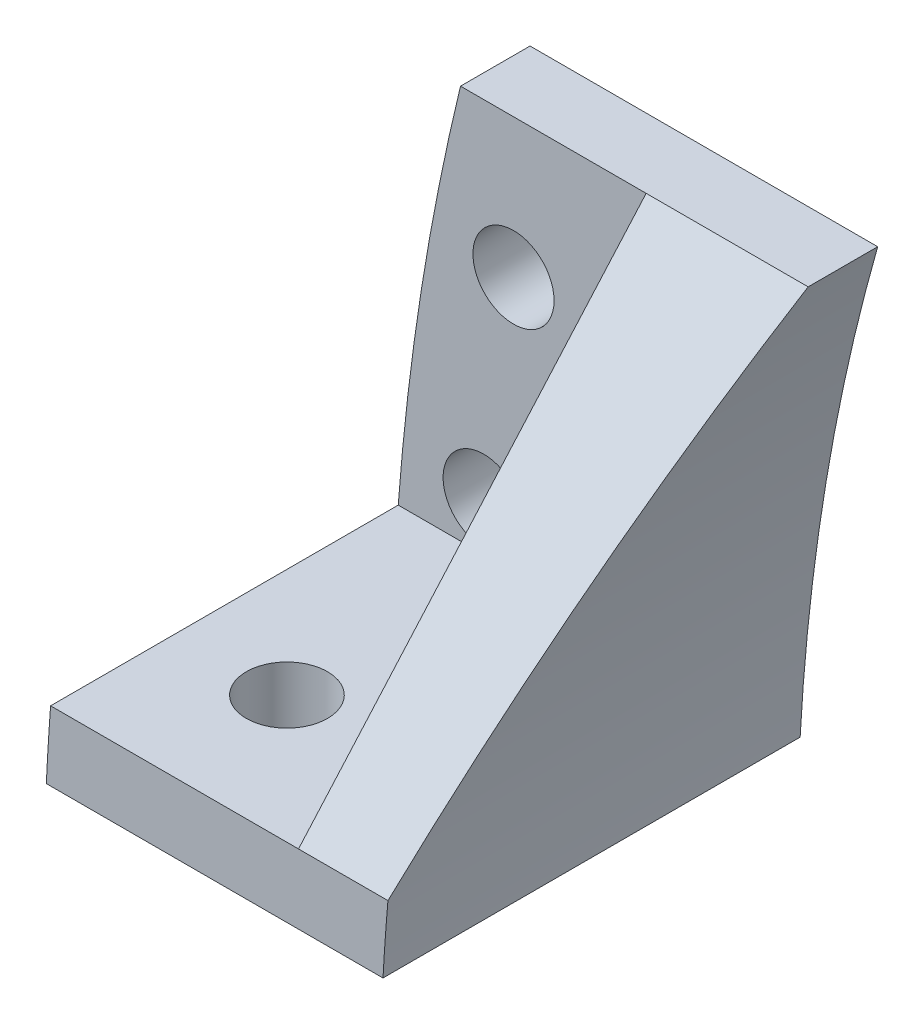
ISO-10303-21;
HEADER;
FILE_DESCRIPTION(('STEP AP214'),'2;1');
FILE_NAME('part.step','',(''),(''),'','','');
FILE_SCHEMA(('AUTOMOTIVE_DESIGN { 1 0 10303 214 1 1 1 1 }'));
ENDSEC;
DATA;
#1=APPLICATION_CONTEXT('core data for automotive mechanical design processes');
#2=APPLICATION_PROTOCOL_DEFINITION('international standard','automotive_design',2000,#1);
#3=PRODUCT_CONTEXT('',#1,'mechanical');
#4=PRODUCT('Part','Part','',(#3));
#5=PRODUCT_RELATED_PRODUCT_CATEGORY('part','',(#4));
#6=PRODUCT_DEFINITION_FORMATION('','',#4);
#7=PRODUCT_DEFINITION_CONTEXT('part definition',#1,'design');
#8=PRODUCT_DEFINITION('design','',#6,#7);
#9=PRODUCT_DEFINITION_SHAPE('','',#8);
#10=(LENGTH_UNIT() NAMED_UNIT(*) SI_UNIT(.MILLI.,.METRE.));
#11=(NAMED_UNIT(*) PLANE_ANGLE_UNIT() SI_UNIT($,.RADIAN.));
#12=(NAMED_UNIT(*) SI_UNIT($,.STERADIAN.) SOLID_ANGLE_UNIT());
#13=UNCERTAINTY_MEASURE_WITH_UNIT(LENGTH_MEASURE(1.E-05),#10,'distance_accuracy_value','');
#14=(GEOMETRIC_REPRESENTATION_CONTEXT(3) GLOBAL_UNCERTAINTY_ASSIGNED_CONTEXT((#13)) GLOBAL_UNIT_ASSIGNED_CONTEXT((#10,
#11,#12)) REPRESENTATION_CONTEXT('',''));
#15=CARTESIAN_POINT('',(0.,0.,0.));
#16=DIRECTION('',(0.,0.,1.));
#17=DIRECTION('',(1.,0.,0.));
#18=AXIS2_PLACEMENT_3D('',#15,#16,#17);
#19=CARTESIAN_POINT('',(106.,0.,3.));
#20=DIRECTION('',(0.,0.,-1.));
#21=DIRECTION('',(-1.,0.,0.));
#22=AXIS2_PLACEMENT_3D('',#19,#20,#21);
#23=PLANE('',#22);
#24=CARTESIAN_POINT('',(3.98897118448416,9.99999999999999,3.));
#25=DIRECTION('',(0.,0.,1.));
#26=DIRECTION('',(1.,0.,0.));
#27=AXIS2_PLACEMENT_3D('',#24,#25,#26);
#28=CIRCLE('',#27,1.75);
#29=CARTESIAN_POINT('',(5.73897118448416,9.99999999999999,3.));
#30=VERTEX_POINT('',#29);
#31=EDGE_CURVE('E120',#30,#30,#28,.T.);
#32=ORIENTED_EDGE('',*,*,#31,.F.);
#33=EDGE_LOOP('',(#32));
#34=FACE_BOUND('',#33,.T.);
#35=CARTESIAN_POINT('',(5.27636821480273,19.,3.));
#36=DIRECTION('',(0.,0.,1.));
#37=DIRECTION('',(1.,0.,0.));
#38=AXIS2_PLACEMENT_3D('',#35,#36,#37);
#39=CIRCLE('',#38,1.75);
#40=CARTESIAN_POINT('',(7.02636821480274,19.,3.));
#41=VERTEX_POINT('',#40);
#42=EDGE_CURVE('E321',#41,#41,#39,.T.);
#43=ORIENTED_EDGE('',*,*,#42,.F.);
#44=EDGE_LOOP('',(#43));
#45=FACE_BOUND('',#44,.T.);
#46=DIRECTION('',(0.,1.,0.));
#47=VECTOR('',#46,1.);
#48=CARTESIAN_POINT('',(11.,25.,3.));
#49=LINE('',#48,#47);
#50=CARTESIAN_POINT('',(11.,7.99999999999999,3.));
#51=VERTEX_POINT('',#50);
#52=CARTESIAN_POINT('',(11.,25.,3.));
#53=VERTEX_POINT('',#52);
#54=EDGE_CURVE('E298',#51,#53,#49,.T.);
#55=ORIENTED_EDGE('',*,*,#54,.T.);
#56=DIRECTION('',(-1.,0.,0.));
#57=VECTOR('',#56,1.);
#58=CARTESIAN_POINT('',(2.9902917196636,25.,3.));
#59=LINE('',#58,#57);
#60=CARTESIAN_POINT('',(2.9902917196636,25.,3.));
#61=VERTEX_POINT('',#60);
#62=EDGE_CURVE('E61',#53,#61,#59,.T.);
#63=ORIENTED_EDGE('',*,*,#62,.T.);
#64=CARTESIAN_POINT('',(106.,0.,3.));
#65=DIRECTION('',(0.,0.,1.));
#66=DIRECTION('',(-1.,0.,0.));
#67=AXIS2_PLACEMENT_3D('',#64,#65,#66);
#68=CIRCLE('',#67,106.);
#69=CARTESIAN_POINT('',(0.302317906209493,7.99999999999999,3.));
#70=VERTEX_POINT('',#69);
#71=EDGE_CURVE('E107',#61,#70,#68,.T.);
#72=ORIENTED_EDGE('',*,*,#71,.T.);
#73=DIRECTION('',(-1.,0.,0.));
#74=VECTOR('',#73,1.);
#75=CARTESIAN_POINT('',(0.302317906209493,7.99999999999999,3.));
#76=LINE('',#75,#74);
#77=EDGE_CURVE('E304',#51,#70,#76,.T.);
#78=ORIENTED_EDGE('',*,*,#77,.F.);
#79=EDGE_LOOP('',(#55,#63,#72,#78));
#80=FACE_BOUND('',#79,.T.);
#81=ADVANCED_FACE('F37',(#34,#45,#80),#23,.F.);
#82=CARTESIAN_POINT('',(0.302317906209493,7.99999999999999,18.));
#83=DIRECTION('',(0.,-1.,0.));
#84=DIRECTION('',(0.,0.,-1.));
#85=AXIS2_PLACEMENT_3D('',#82,#83,#84);
#86=PLANE('',#85);
#87=CARTESIAN_POINT('',(5.,7.99999999999999,12.5));
#88=DIRECTION('',(0.,1.,0.));
#89=DIRECTION('',(0.,0.,1.));
#90=AXIS2_PLACEMENT_3D('',#87,#88,#89);
#91=CIRCLE('',#90,1.75);
#92=CARTESIAN_POINT('',(5.,7.99999999999999,14.25));
#93=VERTEX_POINT('',#92);
#94=EDGE_CURVE('E293',#93,#93,#91,.T.);
#95=ORIENTED_EDGE('',*,*,#94,.F.);
#96=EDGE_LOOP('',(#95));
#97=FACE_BOUND('',#96,.T.);
#98=DIRECTION('',(0.,0.,-1.));
#99=VECTOR('',#98,1.);
#100=CARTESIAN_POINT('',(11.,7.99999999999999,3.));
#101=LINE('',#100,#99);
#102=CARTESIAN_POINT('',(11.,7.99999999999999,18.));
#103=VERTEX_POINT('',#102);
#104=EDGE_CURVE('E52',#103,#51,#101,.T.);
#105=ORIENTED_EDGE('',*,*,#104,.T.);
#106=ORIENTED_EDGE('',*,*,#77,.T.);
#107=DIRECTION('',(0.,0.,-1.));
#108=VECTOR('',#107,1.);
#109=CARTESIAN_POINT('',(0.302317906209493,7.99999999999999,18.));
#110=LINE('',#109,#108);
#111=CARTESIAN_POINT('',(0.302317906209493,7.99999999999999,18.));
#112=VERTEX_POINT('',#111);
#113=EDGE_CURVE('E315',#112,#70,#110,.T.);
#114=ORIENTED_EDGE('',*,*,#113,.F.);
#115=DIRECTION('',(-1.,0.,0.));
#116=VECTOR('',#115,1.);
#117=CARTESIAN_POINT('',(0.302317906209493,7.99999999999999,18.));
#118=LINE('',#117,#116);
#119=EDGE_CURVE('E308',#103,#112,#118,.T.);
#120=ORIENTED_EDGE('',*,*,#119,.F.);
#121=EDGE_LOOP('',(#105,#106,#114,#120));
#122=FACE_BOUND('',#121,.T.);
#123=ADVANCED_FACE('F136',(#97,#122),#86,.F.);
#124=CARTESIAN_POINT('',(106.,0.,0.));
#125=DIRECTION('',(0.,0.,-1.));
#126=DIRECTION('',(-1.,0.,0.));
#127=AXIS2_PLACEMENT_3D('',#124,#125,#126);
#128=PLANE('',#127);
#129=CARTESIAN_POINT('',(3.98897118448416,9.99999999999999,0.));
#130=DIRECTION('',(0.,0.,1.));
#131=DIRECTION('',(1.,0.,0.));
#132=AXIS2_PLACEMENT_3D('',#129,#130,#131);
#133=CIRCLE('',#132,1.75);
#134=CARTESIAN_POINT('',(5.73897118448416,9.99999999999999,0.));
#135=VERTEX_POINT('',#134);
#136=EDGE_CURVE('E324',#135,#135,#133,.T.);
#137=ORIENTED_EDGE('',*,*,#136,.T.);
#138=EDGE_LOOP('',(#137));
#139=FACE_BOUND('',#138,.T.);
#140=CARTESIAN_POINT('',(106.,0.,0.));
#141=DIRECTION('',(0.,0.,1.));
#142=DIRECTION('',(-1.,0.,0.));
#143=AXIS2_PLACEMENT_3D('',#140,#141,#142);
#144=CIRCLE('',#143,106.);
#145=CARTESIAN_POINT('',(2.9902917196636,25.,0.));
#146=VERTEX_POINT('',#145);
#147=CARTESIAN_POINT('',(0.117990196634443,4.99999999999999,0.));
#148=VERTEX_POINT('',#147);
#149=EDGE_CURVE('E106',#146,#148,#144,.T.);
#150=ORIENTED_EDGE('',*,*,#149,.F.);
#151=DIRECTION('',(-1.,0.,0.));
#152=VECTOR('',#151,1.);
#153=CARTESIAN_POINT('',(2.9902917196636,25.,0.));
#154=LINE('',#153,#152);
#155=CARTESIAN_POINT('',(17.9902917196636,25.,0.));
#156=VERTEX_POINT('',#155);
#157=EDGE_CURVE('E92',#156,#146,#154,.T.);
#158=ORIENTED_EDGE('',*,*,#157,.F.);
#159=CARTESIAN_POINT('',(106.,0.,0.));
#160=DIRECTION('',(0.,0.,-1.));
#161=DIRECTION('',(-1.,0.,0.));
#162=AXIS2_PLACEMENT_3D('',#159,#160,#161);
#163=CIRCLE('',#162,91.4915774898974);
#164=CARTESIAN_POINT('',(14.6451492717004,4.99999999999999,0.));
#165=VERTEX_POINT('',#164);
#166=EDGE_CURVE('E81',#165,#156,#163,.T.);
#167=ORIENTED_EDGE('',*,*,#166,.F.);
#168=DIRECTION('',(1.,0.,0.));
#169=VECTOR('',#168,1.);
#170=CARTESIAN_POINT('',(0.117990196634443,4.99999999999999,0.));
#171=LINE('',#170,#169);
#172=EDGE_CURVE('E93',#148,#165,#171,.T.);
#173=ORIENTED_EDGE('',*,*,#172,.F.);
#174=EDGE_LOOP('',(#150,#158,#167,#173));
#175=FACE_BOUND('',#174,.T.);
#176=CARTESIAN_POINT('',(5.27636821480273,19.,0.));
#177=DIRECTION('',(0.,0.,1.));
#178=DIRECTION('',(1.,0.,0.));
#179=AXIS2_PLACEMENT_3D('',#176,#177,#178);
#180=CIRCLE('',#179,1.75);
#181=CARTESIAN_POINT('',(7.02636821480274,19.,0.));
#182=VERTEX_POINT('',#181);
#183=EDGE_CURVE('E320',#182,#182,#180,.T.);
#184=ORIENTED_EDGE('',*,*,#183,.T.);
#185=EDGE_LOOP('',(#184));
#186=FACE_BOUND('',#185,.T.);
#187=ADVANCED_FACE('F103',(#139,#175,#186),#128,.T.);
#188=CARTESIAN_POINT('',(106.,0.,3.));
#189=DIRECTION('',(0.,0.,-1.));
#190=DIRECTION('',(-1.,0.,0.));
#191=AXIS2_PLACEMENT_3D('',#188,#189,#190);
#192=CYLINDRICAL_SURFACE('',#191,106.);
#193=ORIENTED_EDGE('',*,*,#149,.T.);
#194=DIRECTION('',(0.,0.,-1.));
#195=VECTOR('',#194,1.);
#196=CARTESIAN_POINT('',(0.117990196634443,4.99999999999999,3.));
#197=LINE('',#196,#195);
#198=CARTESIAN_POINT('',(0.117990196634429,4.99999999999997,18.));
#199=VERTEX_POINT('',#198);
#200=EDGE_CURVE('E11',#199,#148,#197,.T.);
#201=ORIENTED_EDGE('',*,*,#200,.F.);
#202=CARTESIAN_POINT('',(106.,0.,18.));
#203=DIRECTION('',(0.,0.,1.));
#204=DIRECTION('',(1.,0.,0.));
#205=AXIS2_PLACEMENT_3D('',#202,#203,#204);
#206=CIRCLE('',#205,106.);
#207=EDGE_CURVE('E312',#112,#199,#206,.T.);
#208=ORIENTED_EDGE('',*,*,#207,.F.);
#209=ORIENTED_EDGE('',*,*,#113,.T.);
#210=ORIENTED_EDGE('',*,*,#71,.F.);
#211=DIRECTION('',(0.,0.,-1.));
#212=VECTOR('',#211,1.);
#213=CARTESIAN_POINT('',(2.9902917196636,25.,3.));
#214=LINE('',#213,#212);
#215=EDGE_CURVE('E100',#61,#146,#214,.T.);
#216=ORIENTED_EDGE('',*,*,#215,.T.);
#217=EDGE_LOOP('',(#193,#201,#208,#209,#210,#216));
#218=FACE_BOUND('',#217,.T.);
#219=ADVANCED_FACE('F39',(#218),#192,.T.);
#220=CARTESIAN_POINT('',(0.117990196634443,4.99999999999999,3.));
#221=DIRECTION('',(0.,1.,0.));
#222=DIRECTION('',(0.,0.,1.));
#223=AXIS2_PLACEMENT_3D('',#220,#221,#222);
#224=PLANE('',#223);
#225=CARTESIAN_POINT('',(5.,4.99999999999997,12.5));
#226=DIRECTION('',(0.,1.,0.));
#227=DIRECTION('',(0.,0.,1.));
#228=AXIS2_PLACEMENT_3D('',#225,#226,#227);
#229=CIRCLE('',#228,1.75);
#230=CARTESIAN_POINT('',(5.,4.99999999999997,14.25));
#231=VERTEX_POINT('',#230);
#232=EDGE_CURVE('E290',#231,#231,#229,.T.);
#233=ORIENTED_EDGE('',*,*,#232,.T.);
#234=EDGE_LOOP('',(#233));
#235=FACE_BOUND('',#234,.T.);
#236=ORIENTED_EDGE('',*,*,#172,.T.);
#237=DIRECTION('',(0.,0.,-1.));
#238=VECTOR('',#237,1.);
#239=CARTESIAN_POINT('',(14.6451492717004,4.99999999999999,3.));
#240=LINE('',#239,#238);
#241=CARTESIAN_POINT('',(14.6451492717004,4.99999999999999,18.));
#242=VERTEX_POINT('',#241);
#243=EDGE_CURVE('E45',#242,#165,#240,.T.);
#244=ORIENTED_EDGE('',*,*,#243,.F.);
#245=DIRECTION('',(1.,0.,0.));
#246=VECTOR('',#245,1.);
#247=CARTESIAN_POINT('',(0.117990196634443,4.99999999999999,18.));
#248=LINE('',#247,#246);
#249=EDGE_CURVE('E127',#199,#242,#248,.T.);
#250=ORIENTED_EDGE('',*,*,#249,.F.);
#251=ORIENTED_EDGE('',*,*,#200,.T.);
#252=EDGE_LOOP('',(#236,#244,#250,#251));
#253=FACE_BOUND('',#252,.T.);
#254=ADVANCED_FACE('F122',(#235,#253),#224,.F.);
#255=CARTESIAN_POINT('',(106.,0.,3.));
#256=DIRECTION('',(0.,0.,-1.));
#257=DIRECTION('',(-1.,0.,0.));
#258=AXIS2_PLACEMENT_3D('',#255,#256,#257);
#259=CYLINDRICAL_SURFACE('',#258,91.4915774898974);
#260=DIRECTION('',(0.,0.,-1.));
#261=VECTOR('',#260,1.);
#262=CARTESIAN_POINT('',(17.9902917196636,25.,3.));
#263=LINE('',#262,#261);
#264=CARTESIAN_POINT('',(17.9902917196636,25.,3.));
#265=VERTEX_POINT('',#264);
#266=EDGE_CURVE('E86',#265,#156,#263,.T.);
#267=ORIENTED_EDGE('',*,*,#266,.F.);
#268=CARTESIAN_POINT('',(106.,0.,25.0588235294117));
#269=DIRECTION('',(0.,-0.661621637086846,-0.749837855365092));
#270=DIRECTION('',(0.,0.749837855365093,-0.661621637086846));
#271=AXIS2_PLACEMENT_3D('',#268,#269,#270);
#272=ELLIPSE('',#271,122.015148788868,91.4915774898974);
#273=CARTESIAN_POINT('',(14.8588525879232,7.99999999999999,18.));
#274=VERTEX_POINT('',#273);
#275=EDGE_CURVE('E302',#274,#265,#272,.T.);
#276=ORIENTED_EDGE('',*,*,#275,.F.);
#277=CARTESIAN_POINT('',(106.,0.,18.));
#278=DIRECTION('',(0.,0.,-1.));
#279=DIRECTION('',(1.,0.,0.));
#280=AXIS2_PLACEMENT_3D('',#277,#278,#279);
#281=CIRCLE('',#280,91.4915774898974);
#282=EDGE_CURVE('E305',#242,#274,#281,.T.);
#283=ORIENTED_EDGE('',*,*,#282,.F.);
#284=ORIENTED_EDGE('',*,*,#243,.T.);
#285=ORIENTED_EDGE('',*,*,#166,.T.);
#286=EDGE_LOOP('',(#267,#276,#283,#284,#285));
#287=FACE_BOUND('',#286,.T.);
#288=ADVANCED_FACE('F83',(#287),#259,.F.);
#289=CARTESIAN_POINT('',(2.9902917196636,25.,3.));
#290=DIRECTION('',(0.,-1.,0.));
#291=DIRECTION('',(0.,0.,-1.));
#292=AXIS2_PLACEMENT_3D('',#289,#290,#291);
#293=PLANE('',#292);
#294=ORIENTED_EDGE('',*,*,#157,.T.);
#295=ORIENTED_EDGE('',*,*,#215,.F.);
#296=ORIENTED_EDGE('',*,*,#62,.F.);
#297=EDGE_CURVE('E99',#265,#53,#59,.T.);
#298=ORIENTED_EDGE('',*,*,#297,.F.);
#299=ORIENTED_EDGE('',*,*,#266,.T.);
#300=EDGE_LOOP('',(#294,#295,#296,#298,#299));
#301=FACE_BOUND('',#300,.T.);
#302=ADVANCED_FACE('F96',(#301),#293,.F.);
#303=CARTESIAN_POINT('',(3.98897118448416,9.99999999999999,3.));
#304=DIRECTION('',(0.,0.,-1.));
#305=DIRECTION('',(-1.,0.,0.));
#306=AXIS2_PLACEMENT_3D('',#303,#304,#305);
#307=CYLINDRICAL_SURFACE('',#306,1.75);
#308=ORIENTED_EDGE('',*,*,#31,.T.);
#309=EDGE_LOOP('',(#308));
#310=FACE_BOUND('',#309,.T.);
#311=ORIENTED_EDGE('',*,*,#136,.F.);
#312=EDGE_LOOP('',(#311));
#313=FACE_BOUND('',#312,.T.);
#314=ADVANCED_FACE('F150',(#310,#313),#307,.F.);
#315=CARTESIAN_POINT('',(5.27636821480273,19.,3.));
#316=DIRECTION('',(0.,0.,-1.));
#317=DIRECTION('',(-1.,0.,0.));
#318=AXIS2_PLACEMENT_3D('',#315,#316,#317);
#319=CYLINDRICAL_SURFACE('',#318,1.75);
#320=ORIENTED_EDGE('',*,*,#42,.T.);
#321=EDGE_LOOP('',(#320));
#322=FACE_BOUND('',#321,.T.);
#323=ORIENTED_EDGE('',*,*,#183,.F.);
#324=EDGE_LOOP('',(#323));
#325=FACE_BOUND('',#324,.T.);
#326=ADVANCED_FACE('F171',(#322,#325),#319,.F.);
#327=CARTESIAN_POINT('',(106.,0.,18.));
#328=DIRECTION('',(0.,0.,1.));
#329=DIRECTION('',(1.,0.,0.));
#330=AXIS2_PLACEMENT_3D('',#327,#328,#329);
#331=PLANE('',#330);
#332=ORIENTED_EDGE('',*,*,#282,.T.);
#333=EDGE_CURVE('E309',#274,#103,#118,.T.);
#334=ORIENTED_EDGE('',*,*,#333,.T.);
#335=ORIENTED_EDGE('',*,*,#119,.T.);
#336=ORIENTED_EDGE('',*,*,#207,.T.);
#337=ORIENTED_EDGE('',*,*,#249,.T.);
#338=EDGE_LOOP('',(#332,#334,#335,#336,#337));
#339=FACE_BOUND('',#338,.T.);
#340=ADVANCED_FACE('F179',(#339),#331,.T.);
#341=CARTESIAN_POINT('',(11.,0.,0.));
#342=DIRECTION('',(1.,0.,0.));
#343=DIRECTION('',(0.,0.,-1.));
#344=AXIS2_PLACEMENT_3D('',#341,#342,#343);
#345=PLANE('',#344);
#346=ORIENTED_EDGE('',*,*,#104,.F.);
#347=DIRECTION('',(0.,-0.749837855365092,0.661621637086846));
#348=VECTOR('',#347,1.);
#349=CARTESIAN_POINT('',(11.,7.99999999999999,18.));
#350=LINE('',#349,#348);
#351=EDGE_CURVE('E300',#53,#103,#350,.T.);
#352=ORIENTED_EDGE('',*,*,#351,.F.);
#353=ORIENTED_EDGE('',*,*,#54,.F.);
#354=EDGE_LOOP('',(#346,#352,#353));
#355=FACE_BOUND('',#354,.T.);
#356=ADVANCED_FACE('F185',(#355),#345,.F.);
#357=CARTESIAN_POINT('',(17.9912917196636,7.99999999999999,18.));
#358=DIRECTION('',(0.,-0.661621637086846,-0.749837855365092));
#359=DIRECTION('',(0.,0.749837855365093,-0.661621637086846));
#360=AXIS2_PLACEMENT_3D('',#357,#358,#359);
#361=PLANE('',#360);
#362=ORIENTED_EDGE('',*,*,#333,.F.);
#363=ORIENTED_EDGE('',*,*,#275,.T.);
#364=ORIENTED_EDGE('',*,*,#297,.T.);
#365=ORIENTED_EDGE('',*,*,#351,.T.);
#366=EDGE_LOOP('',(#362,#363,#364,#365));
#367=FACE_BOUND('',#366,.T.);
#368=ADVANCED_FACE('F193',(#367),#361,.F.);
#369=CARTESIAN_POINT('',(5.,4.99999999999997,12.5));
#370=DIRECTION('',(0.,1.,0.));
#371=DIRECTION('',(0.,0.,1.));
#372=AXIS2_PLACEMENT_3D('',#369,#370,#371);
#373=CYLINDRICAL_SURFACE('',#372,1.75);
#374=ORIENTED_EDGE('',*,*,#232,.F.);
#375=EDGE_LOOP('',(#374));
#376=FACE_BOUND('',#375,.T.);
#377=ORIENTED_EDGE('',*,*,#94,.T.);
#378=EDGE_LOOP('',(#377));
#379=FACE_BOUND('',#378,.T.);
#380=ADVANCED_FACE('F200',(#376,#379),#373,.F.);
#381=CLOSED_SHELL('',(#81,#123,#187,#219,#254,#288,#302,#314,#326,#340,#356,#368,#380));
#382=MANIFOLD_SOLID_BREP('B2',#381);
#383=ADVANCED_BREP_SHAPE_REPRESENTATION('',(#18,#382),#14);
#384=SHAPE_DEFINITION_REPRESENTATION(#9,#383);
ENDSEC;
END-ISO-10303-21;
